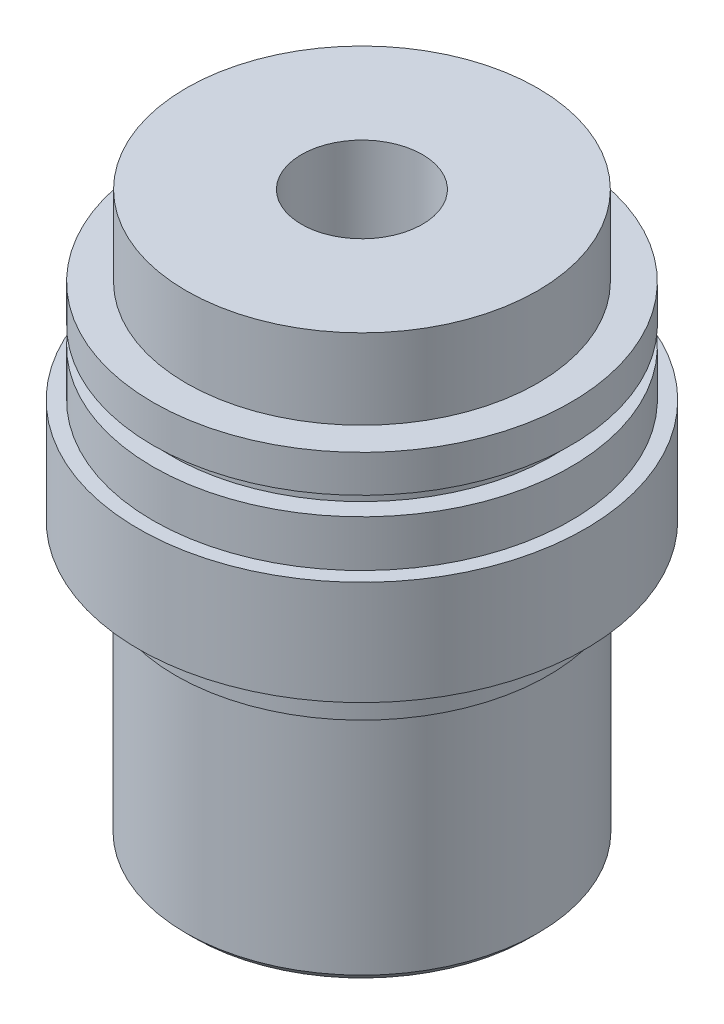
ISO-10303-21;
HEADER;
FILE_DESCRIPTION(('STEP AP214'),'2;1');
FILE_NAME('part.step','',(''),(''),'','','');
FILE_SCHEMA(('AUTOMOTIVE_DESIGN { 1 0 10303 214 1 1 1 1 }'));
ENDSEC;
DATA;
#1=APPLICATION_CONTEXT('core data for automotive mechanical design processes');
#2=APPLICATION_PROTOCOL_DEFINITION('international standard','automotive_design',2000,#1);
#3=PRODUCT_CONTEXT('',#1,'mechanical');
#4=PRODUCT('Part','Part','',(#3));
#5=PRODUCT_RELATED_PRODUCT_CATEGORY('part','',(#4));
#6=PRODUCT_DEFINITION_FORMATION('','',#4);
#7=PRODUCT_DEFINITION_CONTEXT('part definition',#1,'design');
#8=PRODUCT_DEFINITION('design','',#6,#7);
#9=PRODUCT_DEFINITION_SHAPE('','',#8);
#10=(LENGTH_UNIT() NAMED_UNIT(*) SI_UNIT(.MILLI.,.METRE.));
#11=(NAMED_UNIT(*) PLANE_ANGLE_UNIT() SI_UNIT($,.RADIAN.));
#12=(NAMED_UNIT(*) SI_UNIT($,.STERADIAN.) SOLID_ANGLE_UNIT());
#13=UNCERTAINTY_MEASURE_WITH_UNIT(LENGTH_MEASURE(1.E-05),#10,'distance_accuracy_value','');
#14=(GEOMETRIC_REPRESENTATION_CONTEXT(3) GLOBAL_UNCERTAINTY_ASSIGNED_CONTEXT((#13)) GLOBAL_UNIT_ASSIGNED_CONTEXT((#10,
#11,#12)) REPRESENTATION_CONTEXT('',''));
#15=CARTESIAN_POINT('',(0.,0.,0.));
#16=DIRECTION('',(0.,0.,1.));
#17=DIRECTION('',(1.,0.,0.));
#18=AXIS2_PLACEMENT_3D('',#15,#16,#17);
#19=CARTESIAN_POINT('',(9.46,0.,0.));
#20=DIRECTION('',(0.,-1.,0.));
#21=DIRECTION('',(0.,0.,-1.));
#22=AXIS2_PLACEMENT_3D('',#19,#20,#21);
#23=PLANE('',#22);
#24=CARTESIAN_POINT('',(0.,0.,0.));
#25=DIRECTION('',(0.,-1.,0.));
#26=DIRECTION('',(0.,0.,-1.));
#27=AXIS2_PLACEMENT_3D('',#24,#25,#26);
#28=CIRCLE('',#27,9.01);
#29=CARTESIAN_POINT('',(0.,0.,-9.01));
#30=VERTEX_POINT('',#29);
#31=EDGE_CURVE('E48',#30,#30,#28,.T.);
#32=ORIENTED_EDGE('',*,*,#31,.T.);
#33=EDGE_LOOP('',(#32));
#34=FACE_BOUND('',#33,.T.);
#35=CARTESIAN_POINT('',(0.,0.,0.));
#36=DIRECTION('',(0.,-1.,0.));
#37=DIRECTION('',(0.,0.,-1.));
#38=AXIS2_PLACEMENT_3D('',#35,#36,#37);
#39=CIRCLE('',#38,3.7);
#40=CARTESIAN_POINT('',(0.,0.,-3.7));
#41=VERTEX_POINT('',#40);
#42=EDGE_CURVE('E52',#41,#41,#39,.F.);
#43=ORIENTED_EDGE('',*,*,#42,.T.);
#44=EDGE_LOOP('',(#43));
#45=FACE_BOUND('',#44,.T.);
#46=ADVANCED_FACE('F36',(#34,#45),#23,.T.);
#47=CARTESIAN_POINT('',(0.,0.,0.));
#48=DIRECTION('',(0.,-1.,0.));
#49=DIRECTION('',(0.,0.,-1.));
#50=AXIS2_PLACEMENT_3D('',#47,#48,#49);
#51=CYLINDRICAL_SURFACE('',#50,3.25);
#52=CARTESIAN_POINT('',(0.,0.449999999999999,0.));
#53=DIRECTION('',(0.,-1.,0.));
#54=DIRECTION('',(0.,0.,-1.));
#55=AXIS2_PLACEMENT_3D('',#52,#53,#54);
#56=CIRCLE('',#55,3.25);
#57=CARTESIAN_POINT('',(0.,0.449999999999999,-3.25));
#58=VERTEX_POINT('',#57);
#59=EDGE_CURVE('E10',#58,#58,#56,.T.);
#60=ORIENTED_EDGE('',*,*,#59,.T.);
#61=EDGE_LOOP('',(#60));
#62=FACE_BOUND('',#61,.T.);
#63=CARTESIAN_POINT('',(0.,30.33,0.));
#64=DIRECTION('',(0.,-1.,0.));
#65=DIRECTION('',(0.,0.,-1.));
#66=AXIS2_PLACEMENT_3D('',#63,#64,#65);
#67=CIRCLE('',#66,3.25);
#68=CARTESIAN_POINT('',(0.,30.33,-3.25));
#69=VERTEX_POINT('',#68);
#70=EDGE_CURVE('E63',#69,#69,#67,.T.);
#71=ORIENTED_EDGE('',*,*,#70,.F.);
#72=EDGE_LOOP('',(#71));
#73=FACE_BOUND('',#72,.T.);
#74=ADVANCED_FACE('F120',(#62,#73),#51,.F.);
#75=CARTESIAN_POINT('',(3.25,30.33,0.));
#76=DIRECTION('',(0.,1.,0.));
#77=DIRECTION('',(0.,0.,1.));
#78=AXIS2_PLACEMENT_3D('',#75,#76,#77);
#79=PLANE('',#78);
#80=ORIENTED_EDGE('',*,*,#70,.T.);
#81=EDGE_LOOP('',(#80));
#82=FACE_BOUND('',#81,.T.);
#83=CARTESIAN_POINT('',(0.,30.33,0.));
#84=DIRECTION('',(0.,-1.,0.));
#85=DIRECTION('',(0.,0.,-1.));
#86=AXIS2_PLACEMENT_3D('',#83,#84,#85);
#87=CIRCLE('',#86,9.44);
#88=CARTESIAN_POINT('',(0.,30.33,-9.44));
#89=VERTEX_POINT('',#88);
#90=EDGE_CURVE('E66',#89,#89,#87,.T.);
#91=ORIENTED_EDGE('',*,*,#90,.F.);
#92=EDGE_LOOP('',(#91));
#93=FACE_BOUND('',#92,.T.);
#94=ADVANCED_FACE('F126',(#82,#93),#79,.T.);
#95=CARTESIAN_POINT('',(0.,0.,0.));
#96=DIRECTION('',(0.,-1.,0.));
#97=DIRECTION('',(0.,0.,-1.));
#98=AXIS2_PLACEMENT_3D('',#95,#96,#97);
#99=CYLINDRICAL_SURFACE('',#98,9.44);
#100=ORIENTED_EDGE('',*,*,#90,.T.);
#101=EDGE_LOOP('',(#100));
#102=FACE_BOUND('',#101,.T.);
#103=CARTESIAN_POINT('',(0.,26.03,0.));
#104=DIRECTION('',(0.,-1.,0.));
#105=DIRECTION('',(0.,0.,-1.));
#106=AXIS2_PLACEMENT_3D('',#103,#104,#105);
#107=CIRCLE('',#106,9.44);
#108=CARTESIAN_POINT('',(0.,26.03,-9.44));
#109=VERTEX_POINT('',#108);
#110=EDGE_CURVE('E69',#109,#109,#107,.T.);
#111=ORIENTED_EDGE('',*,*,#110,.F.);
#112=EDGE_LOOP('',(#111));
#113=FACE_BOUND('',#112,.T.);
#114=ADVANCED_FACE('F279',(#102,#113),#99,.T.);
#115=CARTESIAN_POINT('',(9.44,26.03,0.));
#116=DIRECTION('',(0.,1.,0.));
#117=DIRECTION('',(0.,0.,1.));
#118=AXIS2_PLACEMENT_3D('',#115,#116,#117);
#119=PLANE('',#118);
#120=ORIENTED_EDGE('',*,*,#110,.T.);
#121=EDGE_LOOP('',(#120));
#122=FACE_BOUND('',#121,.T.);
#123=CARTESIAN_POINT('',(0.,26.03,0.));
#124=DIRECTION('',(0.,-1.,0.));
#125=DIRECTION('',(0.,0.,-1.));
#126=AXIS2_PLACEMENT_3D('',#123,#124,#125);
#127=CIRCLE('',#126,11.225);
#128=CARTESIAN_POINT('',(0.,26.03,-11.225));
#129=VERTEX_POINT('',#128);
#130=EDGE_CURVE('E72',#129,#129,#127,.T.);
#131=ORIENTED_EDGE('',*,*,#130,.F.);
#132=EDGE_LOOP('',(#131));
#133=FACE_BOUND('',#132,.T.);
#134=ADVANCED_FACE('F269',(#122,#133),#119,.T.);
#135=CARTESIAN_POINT('',(0.,0.,0.));
#136=DIRECTION('',(0.,-1.,0.));
#137=DIRECTION('',(0.,0.,-1.));
#138=AXIS2_PLACEMENT_3D('',#135,#136,#137);
#139=CYLINDRICAL_SURFACE('',#138,11.225);
#140=ORIENTED_EDGE('',*,*,#130,.T.);
#141=EDGE_LOOP('',(#140));
#142=FACE_BOUND('',#141,.T.);
#143=CARTESIAN_POINT('',(0.,24.03,0.));
#144=DIRECTION('',(0.,-1.,0.));
#145=DIRECTION('',(0.,0.,-1.));
#146=AXIS2_PLACEMENT_3D('',#143,#144,#145);
#147=CIRCLE('',#146,11.225);
#148=CARTESIAN_POINT('',(0.,24.03,-11.225));
#149=VERTEX_POINT('',#148);
#150=EDGE_CURVE('E75',#149,#149,#147,.T.);
#151=ORIENTED_EDGE('',*,*,#150,.F.);
#152=EDGE_LOOP('',(#151));
#153=FACE_BOUND('',#152,.T.);
#154=ADVANCED_FACE('F259',(#142,#153),#139,.T.);
#155=CARTESIAN_POINT('',(11.225,24.03,0.));
#156=DIRECTION('',(0.,-1.,0.));
#157=DIRECTION('',(0.,0.,-1.));
#158=AXIS2_PLACEMENT_3D('',#155,#156,#157);
#159=PLANE('',#158);
#160=ORIENTED_EDGE('',*,*,#150,.T.);
#161=EDGE_LOOP('',(#160));
#162=FACE_BOUND('',#161,.T.);
#163=CARTESIAN_POINT('',(0.,24.03,0.));
#164=DIRECTION('',(0.,-1.,0.));
#165=DIRECTION('',(0.,0.,-1.));
#166=AXIS2_PLACEMENT_3D('',#163,#164,#165);
#167=CIRCLE('',#166,10.225);
#168=CARTESIAN_POINT('',(0.,24.03,-10.225));
#169=VERTEX_POINT('',#168);
#170=EDGE_CURVE('E78',#169,#169,#167,.T.);
#171=ORIENTED_EDGE('',*,*,#170,.F.);
#172=EDGE_LOOP('',(#171));
#173=FACE_BOUND('',#172,.T.);
#174=ADVANCED_FACE('F249',(#162,#173),#159,.T.);
#175=CARTESIAN_POINT('',(0.,0.,0.));
#176=DIRECTION('',(0.,-1.,0.));
#177=DIRECTION('',(0.,0.,-1.));
#178=AXIS2_PLACEMENT_3D('',#175,#176,#177);
#179=CYLINDRICAL_SURFACE('',#178,10.225);
#180=ORIENTED_EDGE('',*,*,#170,.T.);
#181=EDGE_LOOP('',(#180));
#182=FACE_BOUND('',#181,.T.);
#183=CARTESIAN_POINT('',(0.,23.03,0.));
#184=DIRECTION('',(0.,-1.,0.));
#185=DIRECTION('',(0.,0.,-1.));
#186=AXIS2_PLACEMENT_3D('',#183,#184,#185);
#187=CIRCLE('',#186,10.225);
#188=CARTESIAN_POINT('',(0.,23.03,-10.225));
#189=VERTEX_POINT('',#188);
#190=EDGE_CURVE('E81',#189,#189,#187,.T.);
#191=ORIENTED_EDGE('',*,*,#190,.F.);
#192=EDGE_LOOP('',(#191));
#193=FACE_BOUND('',#192,.T.);
#194=ADVANCED_FACE('F239',(#182,#193),#179,.T.);
#195=CARTESIAN_POINT('',(10.225,23.03,0.));
#196=DIRECTION('',(0.,1.,0.));
#197=DIRECTION('',(0.,0.,1.));
#198=AXIS2_PLACEMENT_3D('',#195,#196,#197);
#199=PLANE('',#198);
#200=ORIENTED_EDGE('',*,*,#190,.T.);
#201=EDGE_LOOP('',(#200));
#202=FACE_BOUND('',#201,.T.);
#203=CARTESIAN_POINT('',(0.,23.03,0.));
#204=DIRECTION('',(0.,-1.,0.));
#205=DIRECTION('',(0.,0.,-1.));
#206=AXIS2_PLACEMENT_3D('',#203,#204,#205);
#207=CIRCLE('',#206,11.225);
#208=CARTESIAN_POINT('',(0.,23.03,-11.225));
#209=VERTEX_POINT('',#208);
#210=EDGE_CURVE('E84',#209,#209,#207,.T.);
#211=ORIENTED_EDGE('',*,*,#210,.F.);
#212=EDGE_LOOP('',(#211));
#213=FACE_BOUND('',#212,.T.);
#214=ADVANCED_FACE('F229',(#202,#213),#199,.T.);
#215=CARTESIAN_POINT('',(0.,0.,0.));
#216=DIRECTION('',(0.,-1.,0.));
#217=DIRECTION('',(0.,0.,-1.));
#218=AXIS2_PLACEMENT_3D('',#215,#216,#217);
#219=CYLINDRICAL_SURFACE('',#218,11.225);
#220=ORIENTED_EDGE('',*,*,#210,.T.);
#221=EDGE_LOOP('',(#220));
#222=FACE_BOUND('',#221,.T.);
#223=CARTESIAN_POINT('',(0.,20.53,0.));
#224=DIRECTION('',(0.,-1.,0.));
#225=DIRECTION('',(0.,0.,-1.));
#226=AXIS2_PLACEMENT_3D('',#223,#224,#225);
#227=CIRCLE('',#226,11.225);
#228=CARTESIAN_POINT('',(0.,20.53,-11.225));
#229=VERTEX_POINT('',#228);
#230=EDGE_CURVE('E87',#229,#229,#227,.T.);
#231=ORIENTED_EDGE('',*,*,#230,.F.);
#232=EDGE_LOOP('',(#231));
#233=FACE_BOUND('',#232,.T.);
#234=ADVANCED_FACE('F219',(#222,#233),#219,.T.);
#235=CARTESIAN_POINT('',(11.225,20.53,0.));
#236=DIRECTION('',(0.,1.,0.));
#237=DIRECTION('',(0.,0.,1.));
#238=AXIS2_PLACEMENT_3D('',#235,#236,#237);
#239=PLANE('',#238);
#240=ORIENTED_EDGE('',*,*,#230,.T.);
#241=EDGE_LOOP('',(#240));
#242=FACE_BOUND('',#241,.T.);
#243=CARTESIAN_POINT('',(0.,20.53,0.));
#244=DIRECTION('',(0.,-1.,0.));
#245=DIRECTION('',(0.,0.,-1.));
#246=AXIS2_PLACEMENT_3D('',#243,#244,#245);
#247=CIRCLE('',#246,12.);
#248=CARTESIAN_POINT('',(0.,20.53,-12.));
#249=VERTEX_POINT('',#248);
#250=EDGE_CURVE('E90',#249,#249,#247,.T.);
#251=ORIENTED_EDGE('',*,*,#250,.F.);
#252=EDGE_LOOP('',(#251));
#253=FACE_BOUND('',#252,.T.);
#254=ADVANCED_FACE('F209',(#242,#253),#239,.T.);
#255=CARTESIAN_POINT('',(0.,0.,0.));
#256=DIRECTION('',(0.,-1.,0.));
#257=DIRECTION('',(0.,0.,-1.));
#258=AXIS2_PLACEMENT_3D('',#255,#256,#257);
#259=CYLINDRICAL_SURFACE('',#258,12.);
#260=ORIENTED_EDGE('',*,*,#250,.T.);
#261=EDGE_LOOP('',(#260));
#262=FACE_BOUND('',#261,.T.);
#263=CARTESIAN_POINT('',(0.,14.93,0.));
#264=DIRECTION('',(0.,-1.,0.));
#265=DIRECTION('',(0.,0.,-1.));
#266=AXIS2_PLACEMENT_3D('',#263,#264,#265);
#267=CIRCLE('',#266,12.);
#268=CARTESIAN_POINT('',(0.,14.93,-12.));
#269=VERTEX_POINT('',#268);
#270=EDGE_CURVE('E93',#269,#269,#267,.T.);
#271=ORIENTED_EDGE('',*,*,#270,.F.);
#272=EDGE_LOOP('',(#271));
#273=FACE_BOUND('',#272,.T.);
#274=ADVANCED_FACE('F184',(#262,#273),#259,.T.);
#275=CARTESIAN_POINT('',(12.,14.93,0.));
#276=DIRECTION('',(0.,-1.,0.));
#277=DIRECTION('',(0.,0.,-1.));
#278=AXIS2_PLACEMENT_3D('',#275,#276,#277);
#279=PLANE('',#278);
#280=CARTESIAN_POINT('',(0.,14.93,0.));
#281=DIRECTION('',(0.,-1.,0.));
#282=DIRECTION('',(0.,0.,-1.));
#283=AXIS2_PLACEMENT_3D('',#280,#281,#282);
#284=CIRCLE('',#283,10.45);
#285=CARTESIAN_POINT('',(0.,14.93,-10.45));
#286=VERTEX_POINT('',#285);
#287=EDGE_CURVE('E57',#286,#286,#284,.F.);
#288=ORIENTED_EDGE('',*,*,#287,.T.);
#289=EDGE_LOOP('',(#288));
#290=FACE_BOUND('',#289,.T.);
#291=ORIENTED_EDGE('',*,*,#270,.T.);
#292=EDGE_LOOP('',(#291));
#293=FACE_BOUND('',#292,.T.);
#294=ADVANCED_FACE('F116',(#290,#293),#279,.T.);
#295=CARTESIAN_POINT('',(0.,0.,0.));
#296=DIRECTION('',(0.,-1.,0.));
#297=DIRECTION('',(0.,0.,-1.));
#298=AXIS2_PLACEMENT_3D('',#295,#296,#297);
#299=CYLINDRICAL_SURFACE('',#298,10.);
#300=CARTESIAN_POINT('',(0.,14.48,0.));
#301=DIRECTION('',(0.,-1.,0.));
#302=DIRECTION('',(0.,0.,-1.));
#303=AXIS2_PLACEMENT_3D('',#300,#301,#302);
#304=CIRCLE('',#303,10.);
#305=CARTESIAN_POINT('',(0.,14.48,-10.));
#306=VERTEX_POINT('',#305);
#307=EDGE_CURVE('E60',#306,#306,#304,.T.);
#308=ORIENTED_EDGE('',*,*,#307,.T.);
#309=EDGE_LOOP('',(#308));
#310=FACE_BOUND('',#309,.T.);
#311=CARTESIAN_POINT('',(0.,12.7,0.));
#312=DIRECTION('',(0.,-1.,0.));
#313=DIRECTION('',(0.,0.,-1.));
#314=AXIS2_PLACEMENT_3D('',#311,#312,#313);
#315=CIRCLE('',#314,10.);
#316=CARTESIAN_POINT('',(0.,12.7,-10.));
#317=VERTEX_POINT('',#316);
#318=EDGE_CURVE('E96',#317,#317,#315,.T.);
#319=ORIENTED_EDGE('',*,*,#318,.F.);
#320=EDGE_LOOP('',(#319));
#321=FACE_BOUND('',#320,.T.);
#322=ADVANCED_FACE('F107',(#310,#321),#299,.T.);
#323=CARTESIAN_POINT('',(10.,12.7,0.));
#324=DIRECTION('',(0.,-1.,0.));
#325=DIRECTION('',(0.,0.,-1.));
#326=AXIS2_PLACEMENT_3D('',#323,#324,#325);
#327=PLANE('',#326);
#328=ORIENTED_EDGE('',*,*,#318,.T.);
#329=EDGE_LOOP('',(#328));
#330=FACE_BOUND('',#329,.T.);
#331=CARTESIAN_POINT('',(0.,12.7,0.));
#332=DIRECTION('',(0.,-1.,0.));
#333=DIRECTION('',(0.,0.,-1.));
#334=AXIS2_PLACEMENT_3D('',#331,#332,#333);
#335=CIRCLE('',#334,9.46);
#336=CARTESIAN_POINT('',(0.,12.7,-9.46));
#337=VERTEX_POINT('',#336);
#338=EDGE_CURVE('E99',#337,#337,#335,.T.);
#339=ORIENTED_EDGE('',*,*,#338,.F.);
#340=EDGE_LOOP('',(#339));
#341=FACE_BOUND('',#340,.T.);
#342=ADVANCED_FACE('F105',(#330,#341),#327,.T.);
#343=CARTESIAN_POINT('',(0.,0.,0.));
#344=DIRECTION('',(0.,-1.,0.));
#345=DIRECTION('',(0.,0.,-1.));
#346=AXIS2_PLACEMENT_3D('',#343,#344,#345);
#347=CYLINDRICAL_SURFACE('',#346,9.46);
#348=CARTESIAN_POINT('',(0.,0.449999999999999,0.));
#349=DIRECTION('',(0.,-1.,0.));
#350=DIRECTION('',(0.,0.,-1.));
#351=AXIS2_PLACEMENT_3D('',#348,#349,#350);
#352=CIRCLE('',#351,9.46);
#353=CARTESIAN_POINT('',(0.,0.449999999999999,-9.46));
#354=VERTEX_POINT('',#353);
#355=EDGE_CURVE('E44',#354,#354,#352,.F.);
#356=ORIENTED_EDGE('',*,*,#355,.T.);
#357=EDGE_LOOP('',(#356));
#358=FACE_BOUND('',#357,.T.);
#359=ORIENTED_EDGE('',*,*,#338,.T.);
#360=EDGE_LOOP('',(#359));
#361=FACE_BOUND('',#360,.T.);
#362=ADVANCED_FACE('F103',(#358,#361),#347,.T.);
#363=CARTESIAN_POINT('',(0.,14.48,0.));
#364=DIRECTION('',(0.,1.,0.));
#365=DIRECTION('',(0.,0.,1.));
#366=AXIS2_PLACEMENT_3D('',#363,#364,#365);
#367=CONICAL_SURFACE('',#366,10.,0.785398163397435);
#368=ORIENTED_EDGE('',*,*,#287,.F.);
#369=EDGE_LOOP('',(#368));
#370=FACE_BOUND('',#369,.T.);
#371=ORIENTED_EDGE('',*,*,#307,.F.);
#372=EDGE_LOOP('',(#371));
#373=FACE_BOUND('',#372,.T.);
#374=ADVANCED_FACE('F114',(#370,#373),#367,.T.);
#375=CARTESIAN_POINT('',(0.,0.,0.));
#376=DIRECTION('',(0.,1.,0.));
#377=DIRECTION('',(0.,0.,1.));
#378=AXIS2_PLACEMENT_3D('',#375,#376,#377);
#379=CONICAL_SURFACE('',#378,9.01,0.785398163397448);
#380=ORIENTED_EDGE('',*,*,#355,.F.);
#381=EDGE_LOOP('',(#380));
#382=FACE_BOUND('',#381,.T.);
#383=ORIENTED_EDGE('',*,*,#31,.F.);
#384=EDGE_LOOP('',(#383));
#385=FACE_BOUND('',#384,.T.);
#386=ADVANCED_FACE('F136',(#382,#385),#379,.T.);
#387=CARTESIAN_POINT('',(0.,0.449999999999999,0.));
#388=DIRECTION('',(0.,-1.,0.));
#389=DIRECTION('',(0.,0.,-1.));
#390=AXIS2_PLACEMENT_3D('',#387,#388,#389);
#391=CONICAL_SURFACE('',#390,3.25,0.785398163397451);
#392=ORIENTED_EDGE('',*,*,#42,.F.);
#393=EDGE_LOOP('',(#392));
#394=FACE_BOUND('',#393,.T.);
#395=ORIENTED_EDGE('',*,*,#59,.F.);
#396=EDGE_LOOP('',(#395));
#397=FACE_BOUND('',#396,.T.);
#398=ADVANCED_FACE('F39',(#394,#397),#391,.F.);
#399=CLOSED_SHELL('',(#46,#74,#94,#114,#134,#154,#174,#194,#214,#234,#254,#274,#294,#322,#342,
#362,#374,#386,#398));
#400=MANIFOLD_SOLID_BREP('B2',#399);
#401=ADVANCED_BREP_SHAPE_REPRESENTATION('',(#18,#400),#14);
#402=SHAPE_DEFINITION_REPRESENTATION(#9,#401);
ENDSEC;
END-ISO-10303-21;
